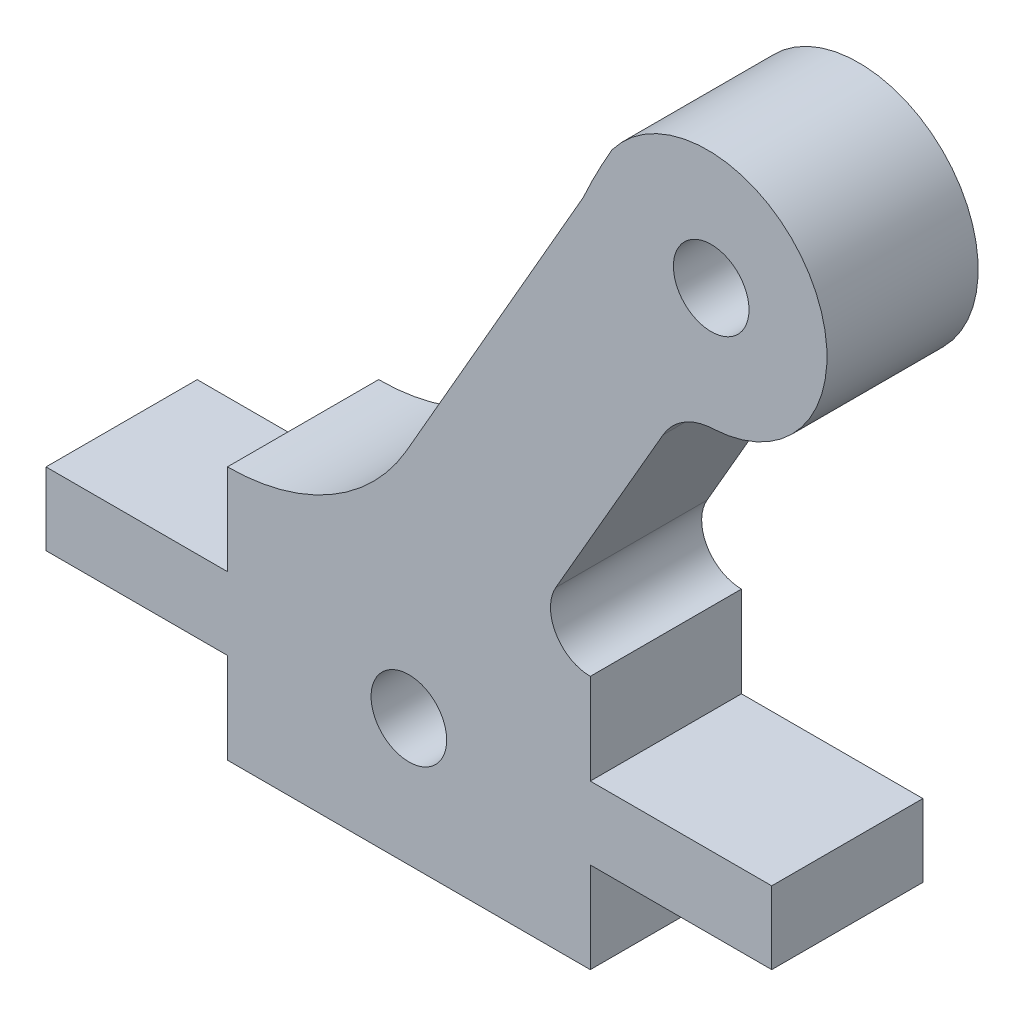
ISO-10303-21;
HEADER;
FILE_DESCRIPTION(('STEP AP214'),'2;1');
FILE_NAME('part.step','',(''),(''),'','','');
FILE_SCHEMA(('AUTOMOTIVE_DESIGN { 1 0 10303 214 1 1 1 1 }'));
ENDSEC;
DATA;
#1=APPLICATION_CONTEXT('core data for automotive mechanical design processes');
#2=APPLICATION_PROTOCOL_DEFINITION('international standard','automotive_design',2000,#1);
#3=PRODUCT_CONTEXT('',#1,'mechanical');
#4=PRODUCT('Part','Part','',(#3));
#5=PRODUCT_RELATED_PRODUCT_CATEGORY('part','',(#4));
#6=PRODUCT_DEFINITION_FORMATION('','',#4);
#7=PRODUCT_DEFINITION_CONTEXT('part definition',#1,'design');
#8=PRODUCT_DEFINITION('design','',#6,#7);
#9=PRODUCT_DEFINITION_SHAPE('','',#8);
#10=(LENGTH_UNIT() NAMED_UNIT(*) SI_UNIT(.MILLI.,.METRE.));
#11=(NAMED_UNIT(*) PLANE_ANGLE_UNIT() SI_UNIT($,.RADIAN.));
#12=(NAMED_UNIT(*) SI_UNIT($,.STERADIAN.) SOLID_ANGLE_UNIT());
#13=UNCERTAINTY_MEASURE_WITH_UNIT(LENGTH_MEASURE(1.E-05),#10,'distance_accuracy_value','');
#14=(GEOMETRIC_REPRESENTATION_CONTEXT(3) GLOBAL_UNCERTAINTY_ASSIGNED_CONTEXT((#13)) GLOBAL_UNIT_ASSIGNED_CONTEXT((#10,
#11,#12)) REPRESENTATION_CONTEXT('',''));
#15=CARTESIAN_POINT('',(0.,0.,0.));
#16=DIRECTION('',(0.,0.,1.));
#17=DIRECTION('',(1.,0.,0.));
#18=AXIS2_PLACEMENT_3D('',#15,#16,#17);
#19=CARTESIAN_POINT('',(2341.43670027167,1598.42524531362,5.));
#20=DIRECTION('',(0.,0.,1.));
#21=DIRECTION('',(1.,0.,0.));
#22=AXIS2_PLACEMENT_3D('',#19,#20,#21);
#23=PLANE('',#22);
#24=CARTESIAN_POINT('',(2357.43608749089,1604.71242653449,5.));
#25=DIRECTION('',(0.,0.,1.));
#26=DIRECTION('',(1.,0.,0.));
#27=AXIS2_PLACEMENT_3D('',#24,#25,#26);
#28=CIRCLE('',#27,1.25000000000008);
#29=CARTESIAN_POINT('',(2358.68608749089,1604.71242653449,5.));
#30=VERTEX_POINT('',#29);
#31=EDGE_CURVE('E206',#30,#30,#28,.T.);
#32=ORIENTED_EDGE('',*,*,#31,.F.);
#33=EDGE_LOOP('',(#32));
#34=FACE_BOUND('',#33,.T.);
#35=DIRECTION('',(-5.30026494942591E-05,0.99999999859536,0.));
#36=VECTOR('',#35,1.);
#37=CARTESIAN_POINT('',(2359.43739818052,1588.59211260654,5.));
#38=LINE('',#37,#36);
#39=CARTESIAN_POINT('',(2359.43752545984,1586.19073605257,5.));
#40=VERTEX_POINT('',#39);
#41=CARTESIAN_POINT('',(2359.43739818052,1588.59211260654,5.));
#42=VERTEX_POINT('',#41);
#43=EDGE_CURVE('E254',#40,#42,#38,.T.);
#44=ORIENTED_EDGE('',*,*,#43,.T.);
#45=DIRECTION('',(-0.999999996597197,-8.24960925022156E-05,0.));
#46=VECTOR('',#45,1.);
#47=CARTESIAN_POINT('',(2359.43739818052,1588.59211260654,5.));
#48=LINE('',#47,#46);
#49=CARTESIAN_POINT('',(2353.43731431986,1588.59161762306,5.));
#50=VERTEX_POINT('',#49);
#51=EDGE_CURVE('E130',#42,#50,#48,.T.);
#52=ORIENTED_EDGE('',*,*,#51,.T.);
#53=DIRECTION('',(-5.89261961890819E-05,0.999999998263852,0.));
#54=VECTOR('',#53,1.);
#55=CARTESIAN_POINT('',(2353.43731431986,1588.59161762306,5.));
#56=LINE('',#55,#54);
#57=CARTESIAN_POINT('',(2353.4371375388,1591.59165955923,5.));
#58=VERTEX_POINT('',#57);
#59=EDGE_CURVE('E315',#50,#58,#56,.T.);
#60=ORIENTED_EDGE('',*,*,#59,.T.);
#61=CARTESIAN_POINT('',(2353.43697506905,1592.90822166619,5.));
#62=DIRECTION('',(0.,0.,-1.));
#63=DIRECTION('',(1.,0.,0.));
#64=AXIS2_PLACEMENT_3D('',#61,#62,#63);
#65=CIRCLE('',#64,1.31656211699262);
#66=CARTESIAN_POINT('',(2352.29676493825,1593.56644401884,5.));
#67=VERTEX_POINT('',#66);
#68=EDGE_CURVE('E335',#58,#67,#65,.T.);
#69=ORIENTED_EDGE('',*,*,#68,.T.);
#70=DIRECTION('',(0.499921488933288,0.866070727425147,0.));
#71=VECTOR('',#70,1.);
#72=CARTESIAN_POINT('',(2352.29676493825,1593.56644401884,5.));
#73=LINE('',#72,#71);
#74=CARTESIAN_POINT('',(2355.84529744894,1599.71396958207,5.));
#75=VERTEX_POINT('',#74);
#76=EDGE_CURVE('E331',#67,#75,#73,.T.);
#77=ORIENTED_EDGE('',*,*,#76,.T.);
#78=CARTESIAN_POINT('',(2357.57746347773,1598.71400546837,5.));
#79=DIRECTION('',(0.,0.,-1.));
#80=DIRECTION('',(1.,0.,0.));
#81=AXIS2_PLACEMENT_3D('',#78,#79,#80);
#82=CIRCLE('',#81,2.00008184332117);
#83=CARTESIAN_POINT('',(2357.5303918755,1600.7135333237,5.));
#84=VERTEX_POINT('',#83);
#85=EDGE_CURVE('E334',#75,#84,#82,.T.);
#86=ORIENTED_EDGE('',*,*,#85,.T.);
#87=CARTESIAN_POINT('',(2357.31493205761,1604.65854984248,5.));
#88=DIRECTION('',(0.,0.,1.));
#89=DIRECTION('',(1.,0.,0.));
#90=AXIS2_PLACEMENT_3D('',#87,#88,#89);
#91=CIRCLE('',#90,3.95089588150782);
#92=CARTESIAN_POINT('',(2354.15513854008,1607.0303177892,5.));
#93=VERTEX_POINT('',#92);
#94=EDGE_CURVE('E339',#84,#93,#91,.T.);
#95=ORIENTED_EDGE('',*,*,#94,.T.);
#96=CARTESIAN_POINT('',(2371.56733502899,1596.86542686183,5.));
#97=DIRECTION('',(0.,0.,1.));
#98=DIRECTION('',(1.,0.,0.));
#99=AXIS2_PLACEMENT_3D('',#96,#97,#98);
#100=CIRCLE('',#99,20.1620830802168);
#101=CARTESIAN_POINT('',(2353.20441586075,1605.19085740652,5.));
#102=VERTEX_POINT('',#101);
#103=EDGE_CURVE('E346',#93,#102,#100,.T.);
#104=ORIENTED_EDGE('',*,*,#103,.T.);
#105=DIRECTION('',(-0.498063420856102,-0.867140604980021,0.));
#106=VECTOR('',#105,1.);
#107=CARTESIAN_POINT('',(2353.20441586075,1605.19085740652,5.));
#108=LINE('',#107,#106);
#109=CARTESIAN_POINT('',(2347.35594945312,1595.00853425939,5.));
#110=VERTEX_POINT('',#109);
#111=EDGE_CURVE('E349',#102,#110,#108,.T.);
#112=ORIENTED_EDGE('',*,*,#111,.T.);
#113=CARTESIAN_POINT('',(2341.43670027167,1598.42524531362,5.));
#114=DIRECTION('',(0.,0.,-1.));
#115=DIRECTION('',(1.,0.,0.));
#116=AXIS2_PLACEMENT_3D('',#113,#114,#115);
#117=CIRCLE('',#116,6.83457572202938);
#118=CARTESIAN_POINT('',(2341.43711123883,1591.59066960394,5.));
#119=VERTEX_POINT('',#118);
#120=EDGE_CURVE('E352',#110,#119,#117,.T.);
#121=ORIENTED_EDGE('',*,*,#120,.T.);
#122=DIRECTION('',(0.00010606598825143,-0.999999994375003,0.));
#123=VECTOR('',#122,1.);
#124=CARTESIAN_POINT('',(2341.43711123883,1591.59066960394,5.));
#125=LINE('',#124,#123);
#126=CARTESIAN_POINT('',(2341.43742944124,1588.59062767945,5.));
#127=VERTEX_POINT('',#126);
#128=EDGE_CURVE('E355',#119,#127,#125,.T.);
#129=ORIENTED_EDGE('',*,*,#128,.T.);
#130=DIRECTION('',(-0.999999996597197,-8.24960926872502E-05,0.));
#131=VECTOR('',#130,1.);
#132=CARTESIAN_POINT('',(2341.43742944124,1588.59062767945,5.));
#133=LINE('',#132,#131);
#134=CARTESIAN_POINT('',(2335.43734558058,1588.59013269597,5.));
#135=VERTEX_POINT('',#134);
#136=EDGE_CURVE('E358',#127,#135,#133,.T.);
#137=ORIENTED_EDGE('',*,*,#136,.T.);
#138=DIRECTION('',(0.000220609882218657,-0.99999997566564,0.));
#139=VECTOR('',#138,1.);
#140=CARTESIAN_POINT('',(2335.4378749112,1586.19073605257,5.));
#141=LINE('',#140,#139);
#142=CARTESIAN_POINT('',(2335.4378749112,1586.19073605257,5.));
#143=VERTEX_POINT('',#142);
#144=EDGE_CURVE('E361',#135,#143,#141,.T.);
#145=ORIENTED_EDGE('',*,*,#144,.T.);
#146=DIRECTION('',(1.,0.,0.));
#147=VECTOR('',#146,1.);
#148=CARTESIAN_POINT('',(2335.4378749112,1586.19073605257,5.));
#149=LINE('',#148,#147);
#150=CARTESIAN_POINT('',(2341.4378749112,1586.19073605257,5.));
#151=VERTEX_POINT('',#150);
#152=EDGE_CURVE('E364',#143,#151,#149,.T.);
#153=ORIENTED_EDGE('',*,*,#152,.T.);
#154=DIRECTION('',(0.,-1.,0.));
#155=VECTOR('',#154,1.);
#156=CARTESIAN_POINT('',(2341.4378749112,1586.19073605257,5.));
#157=LINE('',#156,#155);
#158=CARTESIAN_POINT('',(2341.4378749112,1583.19073605257,5.));
#159=VERTEX_POINT('',#158);
#160=EDGE_CURVE('E179',#151,#159,#157,.T.);
#161=ORIENTED_EDGE('',*,*,#160,.T.);
#162=DIRECTION('',(1.,0.,0.));
#163=VECTOR('',#162,1.);
#164=CARTESIAN_POINT('',(2341.4378749112,1583.19073605257,5.));
#165=LINE('',#164,#163);
#166=CARTESIAN_POINT('',(2353.4378749112,1583.19073605257,5.));
#167=VERTEX_POINT('',#166);
#168=EDGE_CURVE('E173',#159,#167,#165,.T.);
#169=ORIENTED_EDGE('',*,*,#168,.T.);
#170=DIRECTION('',(0.,1.,0.));
#171=VECTOR('',#170,1.);
#172=CARTESIAN_POINT('',(2353.4378749112,1583.19073605257,5.));
#173=LINE('',#172,#171);
#174=CARTESIAN_POINT('',(2353.4378749112,1586.19073605257,5.));
#175=VERTEX_POINT('',#174);
#176=EDGE_CURVE('E177',#167,#175,#173,.T.);
#177=ORIENTED_EDGE('',*,*,#176,.T.);
#178=DIRECTION('',(1.,0.,0.));
#179=VECTOR('',#178,1.);
#180=CARTESIAN_POINT('',(2353.4378749112,1586.19073605257,5.));
#181=LINE('',#180,#179);
#182=EDGE_CURVE('E57',#175,#40,#181,.T.);
#183=ORIENTED_EDGE('',*,*,#182,.T.);
#184=EDGE_LOOP('',(#44,#52,#60,#69,#77,#86,#95,#104,#112,#121,#129,#137,#145,#153,#161,#169,
#177,#183));
#185=FACE_BOUND('',#184,.T.);
#186=CARTESIAN_POINT('',(2347.4374708753,1587.39116244494,5.));
#187=DIRECTION('',(0.,0.,1.));
#188=DIRECTION('',(1.,0.,0.));
#189=AXIS2_PLACEMENT_3D('',#186,#187,#188);
#190=CIRCLE('',#189,1.25000000000008);
#191=CARTESIAN_POINT('',(2348.6874708753,1587.39116244494,5.));
#192=VERTEX_POINT('',#191);
#193=EDGE_CURVE('E408',#192,#192,#190,.T.);
#194=ORIENTED_EDGE('',*,*,#193,.F.);
#195=EDGE_LOOP('',(#194));
#196=FACE_BOUND('',#195,.T.);
#197=ADVANCED_FACE('F39',(#34,#185,#196),#23,.T.);
#198=CARTESIAN_POINT('',(2341.43670027167,1598.42524531362,0.));
#199=DIRECTION('',(0.,0.,1.));
#200=DIRECTION('',(1.,0.,0.));
#201=AXIS2_PLACEMENT_3D('',#198,#199,#200);
#202=PLANE('',#201);
#203=DIRECTION('',(-5.30026494942591E-05,0.99999999859536,0.));
#204=VECTOR('',#203,1.);
#205=CARTESIAN_POINT('',(2359.43739818052,1588.59211260654,0.));
#206=LINE('',#205,#204);
#207=CARTESIAN_POINT('',(2359.43752545984,1586.19073605257,0.));
#208=VERTEX_POINT('',#207);
#209=CARTESIAN_POINT('',(2359.43739818052,1588.59211260654,0.));
#210=VERTEX_POINT('',#209);
#211=EDGE_CURVE('E201',#208,#210,#206,.T.);
#212=ORIENTED_EDGE('',*,*,#211,.F.);
#213=DIRECTION('',(1.,0.,0.));
#214=VECTOR('',#213,1.);
#215=CARTESIAN_POINT('',(2353.4378749112,1586.19073605257,0.));
#216=LINE('',#215,#214);
#217=CARTESIAN_POINT('',(2353.4378749112,1586.19073605257,0.));
#218=VERTEX_POINT('',#217);
#219=EDGE_CURVE('E122',#218,#208,#216,.T.);
#220=ORIENTED_EDGE('',*,*,#219,.F.);
#221=DIRECTION('',(0.,1.,0.));
#222=VECTOR('',#221,1.);
#223=CARTESIAN_POINT('',(2353.4378749112,1583.19073605257,0.));
#224=LINE('',#223,#222);
#225=CARTESIAN_POINT('',(2353.4378749112,1583.19073605257,0.));
#226=VERTEX_POINT('',#225);
#227=EDGE_CURVE('E116',#226,#218,#224,.T.);
#228=ORIENTED_EDGE('',*,*,#227,.F.);
#229=DIRECTION('',(1.,0.,0.));
#230=VECTOR('',#229,1.);
#231=CARTESIAN_POINT('',(2341.4378749112,1583.19073605257,0.));
#232=LINE('',#231,#230);
#233=CARTESIAN_POINT('',(2341.4378749112,1583.19073605257,0.));
#234=VERTEX_POINT('',#233);
#235=EDGE_CURVE('E188',#234,#226,#232,.T.);
#236=ORIENTED_EDGE('',*,*,#235,.F.);
#237=DIRECTION('',(0.,-1.,0.));
#238=VECTOR('',#237,1.);
#239=CARTESIAN_POINT('',(2341.4378749112,1586.19073605257,0.));
#240=LINE('',#239,#238);
#241=CARTESIAN_POINT('',(2341.4378749112,1586.19073605257,0.));
#242=VERTEX_POINT('',#241);
#243=EDGE_CURVE('E245',#242,#234,#240,.T.);
#244=ORIENTED_EDGE('',*,*,#243,.F.);
#245=DIRECTION('',(1.,0.,0.));
#246=VECTOR('',#245,1.);
#247=CARTESIAN_POINT('',(2335.4378749112,1586.19073605257,0.));
#248=LINE('',#247,#246);
#249=CARTESIAN_POINT('',(2335.4378749112,1586.19073605257,0.));
#250=VERTEX_POINT('',#249);
#251=EDGE_CURVE('E242',#250,#242,#248,.T.);
#252=ORIENTED_EDGE('',*,*,#251,.F.);
#253=DIRECTION('',(0.000220609882218657,-0.99999997566564,0.));
#254=VECTOR('',#253,1.);
#255=CARTESIAN_POINT('',(2335.4378749112,1586.19073605257,0.));
#256=LINE('',#255,#254);
#257=CARTESIAN_POINT('',(2335.43734558058,1588.59013269597,0.));
#258=VERTEX_POINT('',#257);
#259=EDGE_CURVE('E239',#258,#250,#256,.T.);
#260=ORIENTED_EDGE('',*,*,#259,.F.);
#261=DIRECTION('',(-0.999999996597197,-8.24960926872502E-05,0.));
#262=VECTOR('',#261,1.);
#263=CARTESIAN_POINT('',(2341.43742944124,1588.59062767945,0.));
#264=LINE('',#263,#262);
#265=CARTESIAN_POINT('',(2341.43742944124,1588.59062767945,0.));
#266=VERTEX_POINT('',#265);
#267=EDGE_CURVE('E236',#266,#258,#264,.T.);
#268=ORIENTED_EDGE('',*,*,#267,.F.);
#269=DIRECTION('',(0.00010606598825143,-0.999999994375003,0.));
#270=VECTOR('',#269,1.);
#271=CARTESIAN_POINT('',(2341.43711123883,1591.59066960394,0.));
#272=LINE('',#271,#270);
#273=CARTESIAN_POINT('',(2341.43711123883,1591.59066960394,0.));
#274=VERTEX_POINT('',#273);
#275=EDGE_CURVE('E233',#274,#266,#272,.T.);
#276=ORIENTED_EDGE('',*,*,#275,.F.);
#277=CARTESIAN_POINT('',(2341.43670027167,1598.42524531362,0.));
#278=DIRECTION('',(0.,0.,-1.));
#279=DIRECTION('',(1.,0.,0.));
#280=AXIS2_PLACEMENT_3D('',#277,#278,#279);
#281=CIRCLE('',#280,6.83457572202938);
#282=CARTESIAN_POINT('',(2347.35594945312,1595.00853425939,0.));
#283=VERTEX_POINT('',#282);
#284=EDGE_CURVE('E230',#283,#274,#281,.T.);
#285=ORIENTED_EDGE('',*,*,#284,.F.);
#286=DIRECTION('',(-0.498063420856102,-0.867140604980021,0.));
#287=VECTOR('',#286,1.);
#288=CARTESIAN_POINT('',(2353.20441586075,1605.19085740652,0.));
#289=LINE('',#288,#287);
#290=CARTESIAN_POINT('',(2353.20441586075,1605.19085740652,0.));
#291=VERTEX_POINT('',#290);
#292=EDGE_CURVE('E227',#291,#283,#289,.T.);
#293=ORIENTED_EDGE('',*,*,#292,.F.);
#294=CARTESIAN_POINT('',(2371.56733502899,1596.86542686183,0.));
#295=DIRECTION('',(0.,0.,1.));
#296=DIRECTION('',(1.,0.,0.));
#297=AXIS2_PLACEMENT_3D('',#294,#295,#296);
#298=CIRCLE('',#297,20.1620830802168);
#299=CARTESIAN_POINT('',(2354.15513854008,1607.0303177892,0.));
#300=VERTEX_POINT('',#299);
#301=EDGE_CURVE('E224',#300,#291,#298,.T.);
#302=ORIENTED_EDGE('',*,*,#301,.F.);
#303=CARTESIAN_POINT('',(2357.31493205761,1604.65854984248,0.));
#304=DIRECTION('',(0.,0.,1.));
#305=DIRECTION('',(1.,0.,0.));
#306=AXIS2_PLACEMENT_3D('',#303,#304,#305);
#307=CIRCLE('',#306,3.95089588150782);
#308=CARTESIAN_POINT('',(2357.5303918755,1600.7135333237,0.));
#309=VERTEX_POINT('',#308);
#310=EDGE_CURVE('E221',#309,#300,#307,.T.);
#311=ORIENTED_EDGE('',*,*,#310,.F.);
#312=CARTESIAN_POINT('',(2357.57746347773,1598.71400546837,0.));
#313=DIRECTION('',(0.,0.,-1.));
#314=DIRECTION('',(1.,0.,0.));
#315=AXIS2_PLACEMENT_3D('',#312,#313,#314);
#316=CIRCLE('',#315,2.00008184332117);
#317=CARTESIAN_POINT('',(2355.84529744894,1599.71396958207,0.));
#318=VERTEX_POINT('',#317);
#319=EDGE_CURVE('E218',#318,#309,#316,.T.);
#320=ORIENTED_EDGE('',*,*,#319,.F.);
#321=DIRECTION('',(0.499921488933288,0.866070727425147,0.));
#322=VECTOR('',#321,1.);
#323=CARTESIAN_POINT('',(2352.29676493825,1593.56644401884,0.));
#324=LINE('',#323,#322);
#325=CARTESIAN_POINT('',(2352.29676493825,1593.56644401884,0.));
#326=VERTEX_POINT('',#325);
#327=EDGE_CURVE('E215',#326,#318,#324,.T.);
#328=ORIENTED_EDGE('',*,*,#327,.F.);
#329=CARTESIAN_POINT('',(2353.43697506905,1592.90822166619,0.));
#330=DIRECTION('',(0.,0.,-1.));
#331=DIRECTION('',(1.,0.,0.));
#332=AXIS2_PLACEMENT_3D('',#329,#330,#331);
#333=CIRCLE('',#332,1.31656211699262);
#334=CARTESIAN_POINT('',(2353.4371375388,1591.59165955923,0.));
#335=VERTEX_POINT('',#334);
#336=EDGE_CURVE('E212',#335,#326,#333,.T.);
#337=ORIENTED_EDGE('',*,*,#336,.F.);
#338=DIRECTION('',(-5.89261961890819E-05,0.999999998263852,0.));
#339=VECTOR('',#338,1.);
#340=CARTESIAN_POINT('',(2353.43731431986,1588.59161762306,0.));
#341=LINE('',#340,#339);
#342=CARTESIAN_POINT('',(2353.43731431986,1588.59161762306,0.));
#343=VERTEX_POINT('',#342);
#344=EDGE_CURVE('E209',#343,#335,#341,.T.);
#345=ORIENTED_EDGE('',*,*,#344,.F.);
#346=DIRECTION('',(-0.999999996597197,-8.24960925022156E-05,0.));
#347=VECTOR('',#346,1.);
#348=CARTESIAN_POINT('',(2359.43739818052,1588.59211260654,0.));
#349=LINE('',#348,#347);
#350=EDGE_CURVE('E205',#210,#343,#349,.T.);
#351=ORIENTED_EDGE('',*,*,#350,.F.);
#352=EDGE_LOOP('',(#212,#220,#228,#236,#244,#252,#260,#268,#276,#285,#293,#302,#311,#320,#328,
#337,#345,#351));
#353=FACE_BOUND('',#352,.T.);
#354=CARTESIAN_POINT('',(2357.43608749089,1604.71242653449,0.));
#355=DIRECTION('',(0.,0.,1.));
#356=DIRECTION('',(1.,0.,0.));
#357=AXIS2_PLACEMENT_3D('',#354,#355,#356);
#358=CIRCLE('',#357,1.25000000000008);
#359=CARTESIAN_POINT('',(2358.68608749089,1604.71242653449,0.));
#360=VERTEX_POINT('',#359);
#361=EDGE_CURVE('E416',#360,#360,#358,.T.);
#362=ORIENTED_EDGE('',*,*,#361,.T.);
#363=EDGE_LOOP('',(#362));
#364=FACE_BOUND('',#363,.T.);
#365=CARTESIAN_POINT('',(2347.4374708753,1587.39116244494,0.));
#366=DIRECTION('',(0.,0.,1.));
#367=DIRECTION('',(1.,0.,0.));
#368=AXIS2_PLACEMENT_3D('',#365,#366,#367);
#369=CIRCLE('',#368,1.25000000000008);
#370=CARTESIAN_POINT('',(2348.6874708753,1587.39116244494,0.));
#371=VERTEX_POINT('',#370);
#372=EDGE_CURVE('E411',#371,#371,#369,.T.);
#373=ORIENTED_EDGE('',*,*,#372,.T.);
#374=EDGE_LOOP('',(#373));
#375=FACE_BOUND('',#374,.T.);
#376=ADVANCED_FACE('F319',(#353,#364,#375),#202,.F.);
#377=CARTESIAN_POINT('',(2359.43739818052,1588.59211260654,5.));
#378=DIRECTION('',(-0.99999999859536,-5.30026494942591E-05,0.));
#379=DIRECTION('',(5.30026494942591E-05,-0.99999999859536,0.));
#380=AXIS2_PLACEMENT_3D('',#377,#378,#379);
#381=PLANE('',#380);
#382=ORIENTED_EDGE('',*,*,#211,.T.);
#383=DIRECTION('',(0.,0.,-1.));
#384=VECTOR('',#383,1.);
#385=CARTESIAN_POINT('',(2359.43739818052,1588.59211260654,5.));
#386=LINE('',#385,#384);
#387=EDGE_CURVE('E11',#42,#210,#386,.T.);
#388=ORIENTED_EDGE('',*,*,#387,.F.);
#389=ORIENTED_EDGE('',*,*,#43,.F.);
#390=DIRECTION('',(0.,0.,-1.));
#391=VECTOR('',#390,1.);
#392=CARTESIAN_POINT('',(2359.43752545984,1586.19073605257,5.));
#393=LINE('',#392,#391);
#394=EDGE_CURVE('E197',#40,#208,#393,.T.);
#395=ORIENTED_EDGE('',*,*,#394,.T.);
#396=EDGE_LOOP('',(#382,#388,#389,#395));
#397=FACE_BOUND('',#396,.T.);
#398=ADVANCED_FACE('F41',(#397),#381,.F.);
#399=CARTESIAN_POINT('',(2359.43739818052,1588.59211260654,5.));
#400=DIRECTION('',(8.24960925022156E-05,-0.999999996597197,0.));
#401=DIRECTION('',(0.999999996597197,8.24960925022156E-05,0.));
#402=AXIS2_PLACEMENT_3D('',#399,#400,#401);
#403=PLANE('',#402);
#404=ORIENTED_EDGE('',*,*,#350,.T.);
#405=DIRECTION('',(0.,0.,-1.));
#406=VECTOR('',#405,1.);
#407=CARTESIAN_POINT('',(2353.43731431986,1588.59161762306,5.));
#408=LINE('',#407,#406);
#409=EDGE_CURVE('E49',#50,#343,#408,.T.);
#410=ORIENTED_EDGE('',*,*,#409,.F.);
#411=ORIENTED_EDGE('',*,*,#51,.F.);
#412=ORIENTED_EDGE('',*,*,#387,.T.);
#413=EDGE_LOOP('',(#404,#410,#411,#412));
#414=FACE_BOUND('',#413,.T.);
#415=ADVANCED_FACE('F574',(#414),#403,.F.);
#416=CARTESIAN_POINT('',(2353.43731431986,1588.59161762306,5.));
#417=DIRECTION('',(-0.999999998263852,-5.89261961890819E-05,0.));
#418=DIRECTION('',(5.89261961890819E-05,-0.999999998263852,0.));
#419=AXIS2_PLACEMENT_3D('',#416,#417,#418);
#420=PLANE('',#419);
#421=ORIENTED_EDGE('',*,*,#344,.T.);
#422=DIRECTION('',(0.,0.,-1.));
#423=VECTOR('',#422,1.);
#424=CARTESIAN_POINT('',(2353.4371375388,1591.59165955923,5.));
#425=LINE('',#424,#423);
#426=EDGE_CURVE('E305',#58,#335,#425,.T.);
#427=ORIENTED_EDGE('',*,*,#426,.F.);
#428=ORIENTED_EDGE('',*,*,#59,.F.);
#429=ORIENTED_EDGE('',*,*,#409,.T.);
#430=EDGE_LOOP('',(#421,#427,#428,#429));
#431=FACE_BOUND('',#430,.T.);
#432=ADVANCED_FACE('F313',(#431),#420,.F.);
#433=CARTESIAN_POINT('',(2353.43697506905,1592.90822166619,5.));
#434=DIRECTION('',(0.,0.,-1.));
#435=DIRECTION('',(-1.,0.,0.));
#436=AXIS2_PLACEMENT_3D('',#433,#434,#435);
#437=CYLINDRICAL_SURFACE('',#436,1.31656211699262);
#438=ORIENTED_EDGE('',*,*,#336,.T.);
#439=DIRECTION('',(0.,0.,-1.));
#440=VECTOR('',#439,1.);
#441=CARTESIAN_POINT('',(2352.29676493825,1593.56644401884,5.));
#442=LINE('',#441,#440);
#443=EDGE_CURVE('E301',#67,#326,#442,.T.);
#444=ORIENTED_EDGE('',*,*,#443,.F.);
#445=ORIENTED_EDGE('',*,*,#68,.F.);
#446=ORIENTED_EDGE('',*,*,#426,.T.);
#447=EDGE_LOOP('',(#438,#444,#445,#446));
#448=FACE_BOUND('',#447,.T.);
#449=ADVANCED_FACE('F325',(#448),#437,.F.);
#450=CARTESIAN_POINT('',(2352.29676493825,1593.56644401884,5.));
#451=DIRECTION('',(-0.866070727425147,0.499921488933289,0.));
#452=DIRECTION('',(-0.499921488933289,-0.866070727425147,0.));
#453=AXIS2_PLACEMENT_3D('',#450,#451,#452);
#454=PLANE('',#453);
#455=ORIENTED_EDGE('',*,*,#327,.T.);
#456=DIRECTION('',(0.,0.,-1.));
#457=VECTOR('',#456,1.);
#458=CARTESIAN_POINT('',(2355.84529744894,1599.71396958207,5.));
#459=LINE('',#458,#457);
#460=EDGE_CURVE('E297',#75,#318,#459,.T.);
#461=ORIENTED_EDGE('',*,*,#460,.F.);
#462=ORIENTED_EDGE('',*,*,#76,.F.);
#463=ORIENTED_EDGE('',*,*,#443,.T.);
#464=EDGE_LOOP('',(#455,#461,#462,#463));
#465=FACE_BOUND('',#464,.T.);
#466=ADVANCED_FACE('F329',(#465),#454,.F.);
#467=CARTESIAN_POINT('',(2357.57746347773,1598.71400546837,5.));
#468=DIRECTION('',(0.,0.,-1.));
#469=DIRECTION('',(-1.,0.,0.));
#470=AXIS2_PLACEMENT_3D('',#467,#468,#469);
#471=CYLINDRICAL_SURFACE('',#470,2.00008184332117);
#472=ORIENTED_EDGE('',*,*,#319,.T.);
#473=DIRECTION('',(0.,0.,-1.));
#474=VECTOR('',#473,1.);
#475=CARTESIAN_POINT('',(2357.5303918755,1600.7135333237,5.));
#476=LINE('',#475,#474);
#477=EDGE_CURVE('E293',#84,#309,#476,.T.);
#478=ORIENTED_EDGE('',*,*,#477,.F.);
#479=ORIENTED_EDGE('',*,*,#85,.F.);
#480=ORIENTED_EDGE('',*,*,#460,.T.);
#481=EDGE_LOOP('',(#472,#478,#479,#480));
#482=FACE_BOUND('',#481,.T.);
#483=ADVANCED_FACE('F539',(#482),#471,.F.);
#484=CARTESIAN_POINT('',(2357.31493205761,1604.65854984248,5.));
#485=DIRECTION('',(0.,0.,-1.));
#486=DIRECTION('',(-1.,0.,0.));
#487=AXIS2_PLACEMENT_3D('',#484,#485,#486);
#488=CYLINDRICAL_SURFACE('',#487,3.95089588150782);
#489=ORIENTED_EDGE('',*,*,#310,.T.);
#490=DIRECTION('',(0.,0.,-1.));
#491=VECTOR('',#490,1.);
#492=CARTESIAN_POINT('',(2354.15513854008,1607.0303177892,5.));
#493=LINE('',#492,#491);
#494=EDGE_CURVE('E289',#93,#300,#493,.T.);
#495=ORIENTED_EDGE('',*,*,#494,.F.);
#496=ORIENTED_EDGE('',*,*,#94,.F.);
#497=ORIENTED_EDGE('',*,*,#477,.T.);
#498=EDGE_LOOP('',(#489,#495,#496,#497));
#499=FACE_BOUND('',#498,.T.);
#500=ADVANCED_FACE('F529',(#499),#488,.T.);
#501=CARTESIAN_POINT('',(2371.56733502899,1596.86542686183,5.));
#502=DIRECTION('',(0.,0.,-1.));
#503=DIRECTION('',(-1.,0.,0.));
#504=AXIS2_PLACEMENT_3D('',#501,#502,#503);
#505=CYLINDRICAL_SURFACE('',#504,20.1620830802168);
#506=ORIENTED_EDGE('',*,*,#301,.T.);
#507=DIRECTION('',(0.,0.,-1.));
#508=VECTOR('',#507,1.);
#509=CARTESIAN_POINT('',(2353.20441586075,1605.19085740652,5.));
#510=LINE('',#509,#508);
#511=EDGE_CURVE('E285',#102,#291,#510,.T.);
#512=ORIENTED_EDGE('',*,*,#511,.F.);
#513=ORIENTED_EDGE('',*,*,#103,.F.);
#514=ORIENTED_EDGE('',*,*,#494,.T.);
#515=EDGE_LOOP('',(#506,#512,#513,#514));
#516=FACE_BOUND('',#515,.T.);
#517=ADVANCED_FACE('F519',(#516),#505,.T.);
#518=CARTESIAN_POINT('',(2353.20441586075,1605.19085740652,5.));
#519=DIRECTION('',(0.867140604980021,-0.498063420856102,0.));
#520=DIRECTION('',(0.498063420856102,0.867140604980021,0.));
#521=AXIS2_PLACEMENT_3D('',#518,#519,#520);
#522=PLANE('',#521);
#523=ORIENTED_EDGE('',*,*,#292,.T.);
#524=DIRECTION('',(0.,0.,-1.));
#525=VECTOR('',#524,1.);
#526=CARTESIAN_POINT('',(2347.35594945312,1595.00853425939,5.));
#527=LINE('',#526,#525);
#528=EDGE_CURVE('E281',#110,#283,#527,.T.);
#529=ORIENTED_EDGE('',*,*,#528,.F.);
#530=ORIENTED_EDGE('',*,*,#111,.F.);
#531=ORIENTED_EDGE('',*,*,#511,.T.);
#532=EDGE_LOOP('',(#523,#529,#530,#531));
#533=FACE_BOUND('',#532,.T.);
#534=ADVANCED_FACE('F509',(#533),#522,.F.);
#535=CARTESIAN_POINT('',(2341.43670027167,1598.42524531362,5.));
#536=DIRECTION('',(0.,0.,-1.));
#537=DIRECTION('',(-1.,0.,0.));
#538=AXIS2_PLACEMENT_3D('',#535,#536,#537);
#539=CYLINDRICAL_SURFACE('',#538,6.83457572202938);
#540=ORIENTED_EDGE('',*,*,#284,.T.);
#541=DIRECTION('',(0.,0.,-1.));
#542=VECTOR('',#541,1.);
#543=CARTESIAN_POINT('',(2341.43711123883,1591.59066960394,5.));
#544=LINE('',#543,#542);
#545=EDGE_CURVE('E277',#119,#274,#544,.T.);
#546=ORIENTED_EDGE('',*,*,#545,.F.);
#547=ORIENTED_EDGE('',*,*,#120,.F.);
#548=ORIENTED_EDGE('',*,*,#528,.T.);
#549=EDGE_LOOP('',(#540,#546,#547,#548));
#550=FACE_BOUND('',#549,.T.);
#551=ADVANCED_FACE('F499',(#550),#539,.F.);
#552=CARTESIAN_POINT('',(2341.43711123883,1591.59066960394,5.));
#553=DIRECTION('',(0.999999994375003,0.00010606598825143,0.));
#554=DIRECTION('',(-0.00010606598825143,0.999999994375003,0.));
#555=AXIS2_PLACEMENT_3D('',#552,#553,#554);
#556=PLANE('',#555);
#557=ORIENTED_EDGE('',*,*,#275,.T.);
#558=DIRECTION('',(0.,0.,-1.));
#559=VECTOR('',#558,1.);
#560=CARTESIAN_POINT('',(2341.43742944124,1588.59062767945,5.));
#561=LINE('',#560,#559);
#562=EDGE_CURVE('E273',#127,#266,#561,.T.);
#563=ORIENTED_EDGE('',*,*,#562,.F.);
#564=ORIENTED_EDGE('',*,*,#128,.F.);
#565=ORIENTED_EDGE('',*,*,#545,.T.);
#566=EDGE_LOOP('',(#557,#563,#564,#565));
#567=FACE_BOUND('',#566,.T.);
#568=ADVANCED_FACE('F489',(#567),#556,.F.);
#569=CARTESIAN_POINT('',(2341.43742944124,1588.59062767945,5.));
#570=DIRECTION('',(8.24960926872502E-05,-0.999999996597197,0.));
#571=DIRECTION('',(0.999999996597197,8.24960926872502E-05,0.));
#572=AXIS2_PLACEMENT_3D('',#569,#570,#571);
#573=PLANE('',#572);
#574=ORIENTED_EDGE('',*,*,#267,.T.);
#575=DIRECTION('',(0.,0.,-1.));
#576=VECTOR('',#575,1.);
#577=CARTESIAN_POINT('',(2335.43734558058,1588.59013269597,5.));
#578=LINE('',#577,#576);
#579=EDGE_CURVE('E269',#135,#258,#578,.T.);
#580=ORIENTED_EDGE('',*,*,#579,.F.);
#581=ORIENTED_EDGE('',*,*,#136,.F.);
#582=ORIENTED_EDGE('',*,*,#562,.T.);
#583=EDGE_LOOP('',(#574,#580,#581,#582));
#584=FACE_BOUND('',#583,.T.);
#585=ADVANCED_FACE('F479',(#584),#573,.F.);
#586=CARTESIAN_POINT('',(2335.4378749112,1586.19073605257,5.));
#587=DIRECTION('',(0.99999997566564,0.000220609882218657,0.));
#588=DIRECTION('',(-0.000220609882218657,0.99999997566564,0.));
#589=AXIS2_PLACEMENT_3D('',#586,#587,#588);
#590=PLANE('',#589);
#591=ORIENTED_EDGE('',*,*,#259,.T.);
#592=DIRECTION('',(0.,0.,-1.));
#593=VECTOR('',#592,1.);
#594=CARTESIAN_POINT('',(2335.4378749112,1586.19073605257,5.));
#595=LINE('',#594,#593);
#596=EDGE_CURVE('E265',#143,#250,#595,.T.);
#597=ORIENTED_EDGE('',*,*,#596,.F.);
#598=ORIENTED_EDGE('',*,*,#144,.F.);
#599=ORIENTED_EDGE('',*,*,#579,.T.);
#600=EDGE_LOOP('',(#591,#597,#598,#599));
#601=FACE_BOUND('',#600,.T.);
#602=ADVANCED_FACE('F470',(#601),#590,.F.);
#603=CARTESIAN_POINT('',(2335.4378749112,1586.19073605257,5.));
#604=DIRECTION('',(0.,1.,0.));
#605=DIRECTION('',(0.,0.,1.));
#606=AXIS2_PLACEMENT_3D('',#603,#604,#605);
#607=PLANE('',#606);
#608=ORIENTED_EDGE('',*,*,#251,.T.);
#609=DIRECTION('',(0.,0.,-1.));
#610=VECTOR('',#609,1.);
#611=CARTESIAN_POINT('',(2341.4378749112,1586.19073605257,5.));
#612=LINE('',#611,#610);
#613=EDGE_CURVE('E261',#151,#242,#612,.T.);
#614=ORIENTED_EDGE('',*,*,#613,.F.);
#615=ORIENTED_EDGE('',*,*,#152,.F.);
#616=ORIENTED_EDGE('',*,*,#596,.T.);
#617=EDGE_LOOP('',(#608,#614,#615,#616));
#618=FACE_BOUND('',#617,.T.);
#619=ADVANCED_FACE('F372',(#618),#607,.F.);
#620=CARTESIAN_POINT('',(2341.4378749112,1586.19073605257,5.));
#621=DIRECTION('',(1.,0.,0.));
#622=DIRECTION('',(0.,0.,-1.));
#623=AXIS2_PLACEMENT_3D('',#620,#621,#622);
#624=PLANE('',#623);
#625=ORIENTED_EDGE('',*,*,#243,.T.);
#626=DIRECTION('',(0.,0.,-1.));
#627=VECTOR('',#626,1.);
#628=CARTESIAN_POINT('',(2341.4378749112,1583.19073605257,5.));
#629=LINE('',#628,#627);
#630=EDGE_CURVE('E190',#159,#234,#629,.T.);
#631=ORIENTED_EDGE('',*,*,#630,.F.);
#632=ORIENTED_EDGE('',*,*,#160,.F.);
#633=ORIENTED_EDGE('',*,*,#613,.T.);
#634=EDGE_LOOP('',(#625,#631,#632,#633));
#635=FACE_BOUND('',#634,.T.);
#636=ADVANCED_FACE('F376',(#635),#624,.F.);
#637=CARTESIAN_POINT('',(2341.4378749112,1583.19073605257,5.));
#638=DIRECTION('',(0.,1.,0.));
#639=DIRECTION('',(0.,0.,1.));
#640=AXIS2_PLACEMENT_3D('',#637,#638,#639);
#641=PLANE('',#640);
#642=ORIENTED_EDGE('',*,*,#235,.T.);
#643=DIRECTION('',(0.,0.,-1.));
#644=VECTOR('',#643,1.);
#645=CARTESIAN_POINT('',(2353.4378749112,1583.19073605257,5.));
#646=LINE('',#645,#644);
#647=EDGE_CURVE('E185',#167,#226,#646,.T.);
#648=ORIENTED_EDGE('',*,*,#647,.F.);
#649=ORIENTED_EDGE('',*,*,#168,.F.);
#650=ORIENTED_EDGE('',*,*,#630,.T.);
#651=EDGE_LOOP('',(#642,#648,#649,#650));
#652=FACE_BOUND('',#651,.T.);
#653=ADVANCED_FACE('F186',(#652),#641,.F.);
#654=CARTESIAN_POINT('',(2353.4378749112,1583.19073605257,5.));
#655=DIRECTION('',(-1.,0.,0.));
#656=DIRECTION('',(0.,0.,1.));
#657=AXIS2_PLACEMENT_3D('',#654,#655,#656);
#658=PLANE('',#657);
#659=ORIENTED_EDGE('',*,*,#227,.T.);
#660=DIRECTION('',(0.,0.,-1.));
#661=VECTOR('',#660,1.);
#662=CARTESIAN_POINT('',(2353.4378749112,1586.19073605257,5.));
#663=LINE('',#662,#661);
#664=EDGE_CURVE('E191',#175,#218,#663,.T.);
#665=ORIENTED_EDGE('',*,*,#664,.F.);
#666=ORIENTED_EDGE('',*,*,#176,.F.);
#667=ORIENTED_EDGE('',*,*,#647,.T.);
#668=EDGE_LOOP('',(#659,#665,#666,#667));
#669=FACE_BOUND('',#668,.T.);
#670=ADVANCED_FACE('F193',(#669),#658,.F.);
#671=CARTESIAN_POINT('',(2353.4378749112,1586.19073605257,5.));
#672=DIRECTION('',(0.,1.,0.));
#673=DIRECTION('',(0.,0.,1.));
#674=AXIS2_PLACEMENT_3D('',#671,#672,#673);
#675=PLANE('',#674);
#676=ORIENTED_EDGE('',*,*,#219,.T.);
#677=ORIENTED_EDGE('',*,*,#394,.F.);
#678=ORIENTED_EDGE('',*,*,#182,.F.);
#679=ORIENTED_EDGE('',*,*,#664,.T.);
#680=EDGE_LOOP('',(#676,#677,#678,#679));
#681=FACE_BOUND('',#680,.T.);
#682=ADVANCED_FACE('F380',(#681),#675,.F.);
#683=CARTESIAN_POINT('',(2357.43608749089,1604.71242653449,5.));
#684=DIRECTION('',(0.,0.,-1.));
#685=DIRECTION('',(-1.,0.,0.));
#686=AXIS2_PLACEMENT_3D('',#683,#684,#685);
#687=CYLINDRICAL_SURFACE('',#686,1.25000000000008);
#688=ORIENTED_EDGE('',*,*,#31,.T.);
#689=EDGE_LOOP('',(#688));
#690=FACE_BOUND('',#689,.T.);
#691=ORIENTED_EDGE('',*,*,#361,.F.);
#692=EDGE_LOOP('',(#691));
#693=FACE_BOUND('',#692,.T.);
#694=ADVANCED_FACE('F382',(#690,#693),#687,.F.);
#695=CARTESIAN_POINT('',(2347.4374708753,1587.39116244494,5.));
#696=DIRECTION('',(0.,0.,-1.));
#697=DIRECTION('',(-1.,0.,0.));
#698=AXIS2_PLACEMENT_3D('',#695,#696,#697);
#699=CYLINDRICAL_SURFACE('',#698,1.25000000000008);
#700=ORIENTED_EDGE('',*,*,#193,.T.);
#701=EDGE_LOOP('',(#700));
#702=FACE_BOUND('',#701,.T.);
#703=ORIENTED_EDGE('',*,*,#372,.F.);
#704=EDGE_LOOP('',(#703));
#705=FACE_BOUND('',#704,.T.);
#706=ADVANCED_FACE('F388',(#702,#705),#699,.F.);
#707=CLOSED_SHELL('',(#197,#376,#398,#415,#432,#449,#466,#483,#500,#517,#534,#551,#568,#585,
#602,#619,#636,#653,#670,#682,#694,#706));
#708=MANIFOLD_SOLID_BREP('B2',#707);
#709=ADVANCED_BREP_SHAPE_REPRESENTATION('',(#18,#708),#14);
#710=SHAPE_DEFINITION_REPRESENTATION(#9,#709);
ENDSEC;
END-ISO-10303-21;
